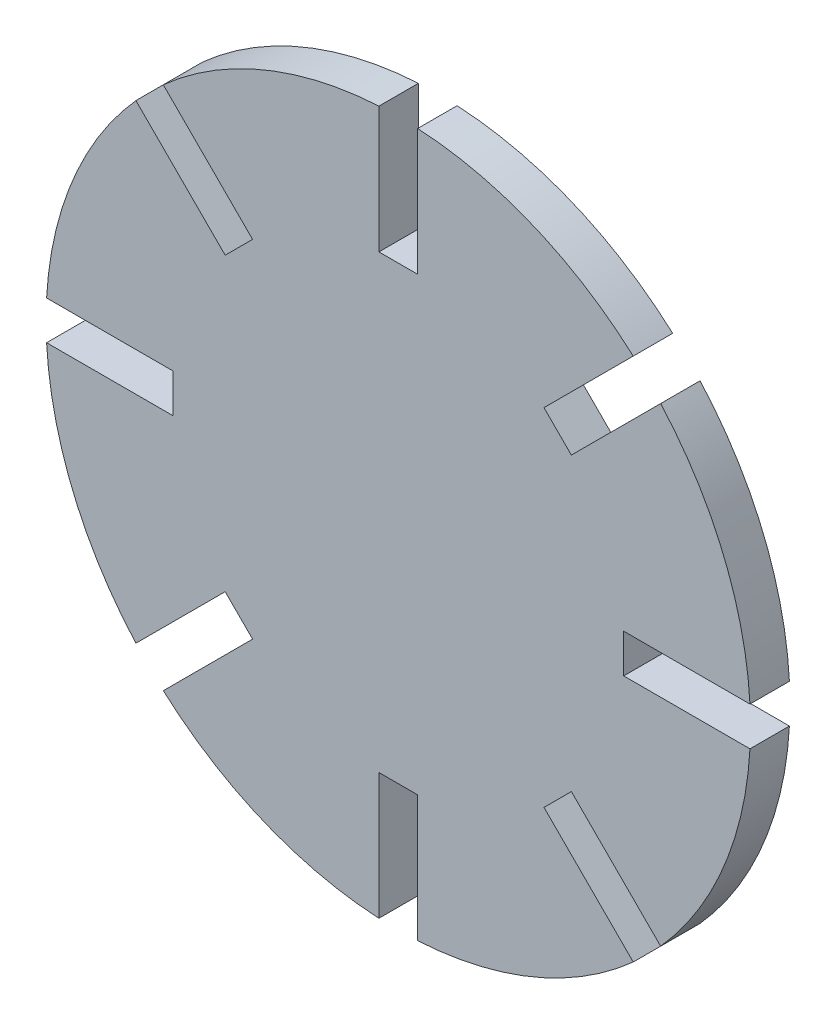
ISO-10303-21;
HEADER;
FILE_DESCRIPTION(('STEP AP214'),'2;1');
FILE_NAME('part.step','',(''),(''),'','','');
FILE_SCHEMA(('AUTOMOTIVE_DESIGN { 1 0 10303 214 1 1 1 1 }'));
ENDSEC;
DATA;
#1=APPLICATION_CONTEXT('core data for automotive mechanical design processes');
#2=APPLICATION_PROTOCOL_DEFINITION('international standard','automotive_design',2000,#1);
#3=PRODUCT_CONTEXT('',#1,'mechanical');
#4=PRODUCT('Part','Part','',(#3));
#5=PRODUCT_RELATED_PRODUCT_CATEGORY('part','',(#4));
#6=PRODUCT_DEFINITION_FORMATION('','',#4);
#7=PRODUCT_DEFINITION_CONTEXT('part definition',#1,'design');
#8=PRODUCT_DEFINITION('design','',#6,#7);
#9=PRODUCT_DEFINITION_SHAPE('','',#8);
#10=(LENGTH_UNIT() NAMED_UNIT(*) SI_UNIT(.MILLI.,.METRE.));
#11=(NAMED_UNIT(*) PLANE_ANGLE_UNIT() SI_UNIT($,.RADIAN.));
#12=(NAMED_UNIT(*) SI_UNIT($,.STERADIAN.) SOLID_ANGLE_UNIT());
#13=UNCERTAINTY_MEASURE_WITH_UNIT(LENGTH_MEASURE(1.E-05),#10,'distance_accuracy_value','');
#14=(GEOMETRIC_REPRESENTATION_CONTEXT(3) GLOBAL_UNCERTAINTY_ASSIGNED_CONTEXT((#13)) GLOBAL_UNIT_ASSIGNED_CONTEXT((#10,
#11,#12)) REPRESENTATION_CONTEXT('',''));
#15=CARTESIAN_POINT('',(0.,0.,0.));
#16=DIRECTION('',(0.,0.,1.));
#17=DIRECTION('',(1.,0.,0.));
#18=AXIS2_PLACEMENT_3D('',#15,#16,#17);
#19=CARTESIAN_POINT('',(0.,0.,2.8));
#20=DIRECTION('',(0.,0.,-1.));
#21=DIRECTION('',(-1.,0.,0.));
#22=AXIS2_PLACEMENT_3D('',#19,#20,#21);
#23=CYLINDRICAL_SURFACE('',#22,25.);
#24=DIRECTION('',(0.,0.,-1.));
#25=VECTOR('',#24,1.);
#26=CARTESIAN_POINT('',(-24.9621588609639,1.37499999999991,2.8));
#27=LINE('',#26,#25);
#28=CARTESIAN_POINT('',(-24.9621588609639,1.37499999999991,2.8));
#29=VERTEX_POINT('',#28);
#30=CARTESIAN_POINT('',(-24.9621588609639,1.37499999999991,0.));
#31=VERTEX_POINT('',#30);
#32=EDGE_CURVE('E397',#29,#31,#27,.T.);
#33=ORIENTED_EDGE('',*,*,#32,.F.);
#34=CARTESIAN_POINT('',(0.,0.,2.8));
#35=DIRECTION('',(0.,0.,1.));
#36=DIRECTION('',(1.,0.,0.));
#37=AXIS2_PLACEMENT_3D('',#34,#35,#36);
#38=CIRCLE('',#37,25.);
#39=CARTESIAN_POINT('',(-18.623183627775,16.6786399795119,2.8));
#40=VERTEX_POINT('',#39);
#41=EDGE_CURVE('E427',#40,#29,#38,.T.);
#42=ORIENTED_EDGE('',*,*,#41,.F.);
#43=DIRECTION('',(0.,0.,-1.));
#44=VECTOR('',#43,1.);
#45=CARTESIAN_POINT('',(-18.623183627775,16.6786399795119,2.8));
#46=LINE('',#45,#44);
#47=CARTESIAN_POINT('',(-18.623183627775,16.6786399795119,0.));
#48=VERTEX_POINT('',#47);
#49=EDGE_CURVE('E372',#48,#40,#46,.F.);
#50=ORIENTED_EDGE('',*,*,#49,.F.);
#51=CARTESIAN_POINT('',(0.,0.,0.));
#52=DIRECTION('',(0.,0.,1.));
#53=DIRECTION('',(1.,0.,0.));
#54=AXIS2_PLACEMENT_3D('',#51,#52,#53);
#55=CIRCLE('',#54,25.);
#56=EDGE_CURVE('E432',#48,#31,#55,.T.);
#57=ORIENTED_EDGE('',*,*,#56,.T.);
#58=EDGE_LOOP('',(#33,#42,#50,#57));
#59=FACE_BOUND('',#58,.T.);
#60=ADVANCED_FACE('F33',(#59),#23,.T.);
#61=DIRECTION('',(0.,0.,-1.));
#62=VECTOR('',#61,1.);
#63=CARTESIAN_POINT('',(-24.9621588609639,-1.37500000000009,2.8));
#64=LINE('',#63,#62);
#65=CARTESIAN_POINT('',(-24.9621588609639,-1.37500000000009,0.));
#66=VERTEX_POINT('',#65);
#67=CARTESIAN_POINT('',(-24.9621588609639,-1.37500000000009,2.8));
#68=VERTEX_POINT('',#67);
#69=EDGE_CURVE('E395',#66,#68,#64,.F.);
#70=ORIENTED_EDGE('',*,*,#69,.F.);
#71=CARTESIAN_POINT('',(-18.6231836277749,-16.6786399795121,0.));
#72=VERTEX_POINT('',#71);
#73=EDGE_CURVE('E461',#66,#72,#55,.T.);
#74=ORIENTED_EDGE('',*,*,#73,.T.);
#75=DIRECTION('',(0.,0.,-1.));
#76=VECTOR('',#75,1.);
#77=CARTESIAN_POINT('',(-18.6231836277749,-16.6786399795121,2.8));
#78=LINE('',#77,#76);
#79=CARTESIAN_POINT('',(-18.6231836277749,-16.6786399795121,2.8));
#80=VERTEX_POINT('',#79);
#81=EDGE_CURVE('E393',#80,#72,#78,.T.);
#82=ORIENTED_EDGE('',*,*,#81,.F.);
#83=EDGE_CURVE('E511',#68,#80,#38,.T.);
#84=ORIENTED_EDGE('',*,*,#83,.F.);
#85=EDGE_LOOP('',(#70,#74,#82,#84));
#86=FACE_BOUND('',#85,.T.);
#87=ADVANCED_FACE('F539',(#86),#23,.T.);
#88=DIRECTION('',(0.,0.,-1.));
#89=VECTOR('',#88,1.);
#90=CARTESIAN_POINT('',(-16.6786399795119,-18.6231836277751,2.8));
#91=LINE('',#90,#89);
#92=CARTESIAN_POINT('',(-16.6786399795119,-18.6231836277751,0.));
#93=VERTEX_POINT('',#92);
#94=CARTESIAN_POINT('',(-16.6786399795119,-18.6231836277751,2.8));
#95=VERTEX_POINT('',#94);
#96=EDGE_CURVE('E391',#93,#95,#91,.F.);
#97=ORIENTED_EDGE('',*,*,#96,.F.);
#98=CARTESIAN_POINT('',(-1.375,-24.9621588609639,0.));
#99=VERTEX_POINT('',#98);
#100=EDGE_CURVE('E457',#93,#99,#55,.T.);
#101=ORIENTED_EDGE('',*,*,#100,.T.);
#102=DIRECTION('',(0.,0.,-1.));
#103=VECTOR('',#102,1.);
#104=CARTESIAN_POINT('',(-1.375,-24.9621588609639,2.8));
#105=LINE('',#104,#103);
#106=CARTESIAN_POINT('',(-1.375,-24.9621588609639,2.8));
#107=VERTEX_POINT('',#106);
#108=EDGE_CURVE('E389',#107,#99,#105,.T.);
#109=ORIENTED_EDGE('',*,*,#108,.F.);
#110=EDGE_CURVE('E459',#95,#107,#38,.T.);
#111=ORIENTED_EDGE('',*,*,#110,.F.);
#112=EDGE_LOOP('',(#97,#101,#109,#111));
#113=FACE_BOUND('',#112,.T.);
#114=ADVANCED_FACE('F455',(#113),#23,.T.);
#115=DIRECTION('',(0.,0.,-1.));
#116=VECTOR('',#115,1.);
#117=CARTESIAN_POINT('',(1.375,-24.9621588609639,2.8));
#118=LINE('',#117,#116);
#119=CARTESIAN_POINT('',(1.375,-24.9621588609639,0.));
#120=VERTEX_POINT('',#119);
#121=CARTESIAN_POINT('',(1.375,-24.9621588609639,2.8));
#122=VERTEX_POINT('',#121);
#123=EDGE_CURVE('E387',#120,#122,#118,.F.);
#124=ORIENTED_EDGE('',*,*,#123,.F.);
#125=CARTESIAN_POINT('',(16.6786399795121,-18.6231836277748,0.));
#126=VERTEX_POINT('',#125);
#127=EDGE_CURVE('E462',#120,#126,#55,.T.);
#128=ORIENTED_EDGE('',*,*,#127,.T.);
#129=DIRECTION('',(0.,0.,-1.));
#130=VECTOR('',#129,1.);
#131=CARTESIAN_POINT('',(16.6786399795121,-18.6231836277748,2.8));
#132=LINE('',#131,#130);
#133=CARTESIAN_POINT('',(16.6786399795121,-18.6231836277748,2.8));
#134=VERTEX_POINT('',#133);
#135=EDGE_CURVE('E385',#134,#126,#132,.T.);
#136=ORIENTED_EDGE('',*,*,#135,.F.);
#137=EDGE_CURVE('E504',#122,#134,#38,.T.);
#138=ORIENTED_EDGE('',*,*,#137,.F.);
#139=EDGE_LOOP('',(#124,#128,#136,#138));
#140=FACE_BOUND('',#139,.T.);
#141=ADVANCED_FACE('F792',(#140),#23,.T.);
#142=DIRECTION('',(0.,0.,-1.));
#143=VECTOR('',#142,1.);
#144=CARTESIAN_POINT('',(18.6231836277751,-16.6786399795118,2.8));
#145=LINE('',#144,#143);
#146=CARTESIAN_POINT('',(18.6231836277751,-16.6786399795118,0.));
#147=VERTEX_POINT('',#146);
#148=CARTESIAN_POINT('',(18.6231836277751,-16.6786399795118,2.8));
#149=VERTEX_POINT('',#148);
#150=EDGE_CURVE('E383',#147,#149,#145,.F.);
#151=ORIENTED_EDGE('',*,*,#150,.F.);
#152=CARTESIAN_POINT('',(24.9621588609639,-1.37499999999974,0.));
#153=VERTEX_POINT('',#152);
#154=EDGE_CURVE('E465',#147,#153,#55,.T.);
#155=ORIENTED_EDGE('',*,*,#154,.T.);
#156=DIRECTION('',(0.,0.,-1.));
#157=VECTOR('',#156,1.);
#158=CARTESIAN_POINT('',(24.9621588609639,-1.37499999999974,2.8));
#159=LINE('',#158,#157);
#160=CARTESIAN_POINT('',(24.9621588609639,-1.37499999999974,2.8));
#161=VERTEX_POINT('',#160);
#162=EDGE_CURVE('E381',#161,#153,#159,.T.);
#163=ORIENTED_EDGE('',*,*,#162,.F.);
#164=EDGE_CURVE('E502',#149,#161,#38,.T.);
#165=ORIENTED_EDGE('',*,*,#164,.F.);
#166=EDGE_LOOP('',(#151,#155,#163,#165));
#167=FACE_BOUND('',#166,.T.);
#168=ADVANCED_FACE('F798',(#167),#23,.T.);
#169=DIRECTION('',(0.,0.,-1.));
#170=VECTOR('',#169,1.);
#171=CARTESIAN_POINT('',(24.9621588609639,1.37500000000026,2.8));
#172=LINE('',#171,#170);
#173=CARTESIAN_POINT('',(24.9621588609639,1.37500000000026,0.));
#174=VERTEX_POINT('',#173);
#175=CARTESIAN_POINT('',(24.9621588609639,1.37500000000026,2.8));
#176=VERTEX_POINT('',#175);
#177=EDGE_CURVE('E247',#174,#176,#172,.F.);
#178=ORIENTED_EDGE('',*,*,#177,.F.);
#179=CARTESIAN_POINT('',(18.6231836277748,16.6786399795122,0.));
#180=VERTEX_POINT('',#179);
#181=EDGE_CURVE('E471',#174,#180,#55,.T.);
#182=ORIENTED_EDGE('',*,*,#181,.T.);
#183=DIRECTION('',(0.,0.,-1.));
#184=VECTOR('',#183,1.);
#185=CARTESIAN_POINT('',(18.6231836277748,16.6786399795122,2.8));
#186=LINE('',#185,#184);
#187=CARTESIAN_POINT('',(18.6231836277748,16.6786399795122,2.8));
#188=VERTEX_POINT('',#187);
#189=EDGE_CURVE('E378',#188,#180,#186,.T.);
#190=ORIENTED_EDGE('',*,*,#189,.F.);
#191=EDGE_CURVE('E501',#176,#188,#38,.T.);
#192=ORIENTED_EDGE('',*,*,#191,.F.);
#193=EDGE_LOOP('',(#178,#182,#190,#192));
#194=FACE_BOUND('',#193,.T.);
#195=ADVANCED_FACE('F565',(#194),#23,.T.);
#196=DIRECTION('',(0.,0.,-1.));
#197=VECTOR('',#196,1.);
#198=CARTESIAN_POINT('',(16.6786399795117,18.6231836277752,2.8));
#199=LINE('',#198,#197);
#200=CARTESIAN_POINT('',(16.6786399795117,18.6231836277752,0.));
#201=VERTEX_POINT('',#200);
#202=CARTESIAN_POINT('',(16.6786399795117,18.6231836277752,2.8));
#203=VERTEX_POINT('',#202);
#204=EDGE_CURVE('E376',#201,#203,#199,.F.);
#205=ORIENTED_EDGE('',*,*,#204,.F.);
#206=CARTESIAN_POINT('',(1.375,24.9621588609639,0.));
#207=VERTEX_POINT('',#206);
#208=EDGE_CURVE('E422',#201,#207,#55,.T.);
#209=ORIENTED_EDGE('',*,*,#208,.T.);
#210=DIRECTION('',(0.,0.,-1.));
#211=VECTOR('',#210,1.);
#212=CARTESIAN_POINT('',(1.375,24.9621588609639,2.8));
#213=LINE('',#212,#211);
#214=CARTESIAN_POINT('',(1.375,24.9621588609639,2.8));
#215=VERTEX_POINT('',#214);
#216=EDGE_CURVE('E419',#215,#207,#213,.T.);
#217=ORIENTED_EDGE('',*,*,#216,.F.);
#218=EDGE_CURVE('E428',#203,#215,#38,.T.);
#219=ORIENTED_EDGE('',*,*,#218,.F.);
#220=EDGE_LOOP('',(#205,#209,#217,#219));
#221=FACE_BOUND('',#220,.T.);
#222=ADVANCED_FACE('F484',(#221),#23,.T.);
#223=DIRECTION('',(0.,0.,-1.));
#224=VECTOR('',#223,1.);
#225=CARTESIAN_POINT('',(-16.678639979512,18.6231836277749,2.8));
#226=LINE('',#225,#224);
#227=CARTESIAN_POINT('',(-16.678639979512,18.6231836277749,2.8));
#228=VERTEX_POINT('',#227);
#229=CARTESIAN_POINT('',(-16.678639979512,18.6231836277749,0.));
#230=VERTEX_POINT('',#229);
#231=EDGE_CURVE('E374',#228,#230,#226,.T.);
#232=ORIENTED_EDGE('',*,*,#231,.F.);
#233=CARTESIAN_POINT('',(-1.375,24.9621588609639,2.8));
#234=VERTEX_POINT('',#233);
#235=EDGE_CURVE('E423',#234,#228,#38,.T.);
#236=ORIENTED_EDGE('',*,*,#235,.F.);
#237=DIRECTION('',(0.,0.,-1.));
#238=VECTOR('',#237,1.);
#239=CARTESIAN_POINT('',(-1.375,24.9621588609639,2.8));
#240=LINE('',#239,#238);
#241=CARTESIAN_POINT('',(-1.375,24.9621588609639,0.));
#242=VERTEX_POINT('',#241);
#243=EDGE_CURVE('E417',#242,#234,#240,.F.);
#244=ORIENTED_EDGE('',*,*,#243,.F.);
#245=EDGE_CURVE('E429',#242,#230,#55,.T.);
#246=ORIENTED_EDGE('',*,*,#245,.T.);
#247=EDGE_LOOP('',(#232,#236,#244,#246));
#248=FACE_BOUND('',#247,.T.);
#249=ADVANCED_FACE('F554',(#248),#23,.T.);
#250=CARTESIAN_POINT('',(0.,0.,2.8));
#251=DIRECTION('',(0.,0.,1.));
#252=DIRECTION('',(1.,0.,0.));
#253=AXIS2_PLACEMENT_3D('',#250,#251,#252);
#254=PLANE('',#253);
#255=ORIENTED_EDGE('',*,*,#41,.T.);
#256=DIRECTION('',(-1.,0.,0.));
#257=VECTOR('',#256,1.);
#258=CARTESIAN_POINT('',(-34.,1.37499999999988,2.8));
#259=LINE('',#258,#257);
#260=CARTESIAN_POINT('',(-16.,1.37499999999995,2.8));
#261=VERTEX_POINT('',#260);
#262=EDGE_CURVE('E294',#261,#29,#259,.T.);
#263=ORIENTED_EDGE('',*,*,#262,.F.);
#264=DIRECTION('',(0.,1.,0.));
#265=VECTOR('',#264,1.);
#266=CARTESIAN_POINT('',(-16.,-1.37500000000005,2.8));
#267=LINE('',#266,#265);
#268=CARTESIAN_POINT('',(-16.,-1.37500000000005,2.8));
#269=VERTEX_POINT('',#268);
#270=EDGE_CURVE('E299',#269,#261,#267,.T.);
#271=ORIENTED_EDGE('',*,*,#270,.F.);
#272=DIRECTION('',(1.,0.,0.));
#273=VECTOR('',#272,1.);
#274=CARTESIAN_POINT('',(-34.,-1.37500000000012,2.8));
#275=LINE('',#274,#273);
#276=EDGE_CURVE('E296',#68,#269,#275,.T.);
#277=ORIENTED_EDGE('',*,*,#276,.F.);
#278=ORIENTED_EDGE('',*,*,#83,.T.);
#279=DIRECTION('',(-0.707106781186544,-0.707106781186551,0.));
#280=VECTOR('',#279,1.);
#281=CARTESIAN_POINT('',(-25.013902384474,-23.0693587362112,2.8));
#282=LINE('',#281,#280);
#283=CARTESIAN_POINT('',(-12.2859803231162,-10.3414366748533,2.8));
#284=VERTEX_POINT('',#283);
#285=EDGE_CURVE('E310',#284,#80,#282,.T.);
#286=ORIENTED_EDGE('',*,*,#285,.F.);
#287=DIRECTION('',(-0.707106781186551,0.707106781186544,0.));
#288=VECTOR('',#287,1.);
#289=CARTESIAN_POINT('',(-10.3414366748532,-12.2859803231163,2.8));
#290=LINE('',#289,#288);
#291=CARTESIAN_POINT('',(-10.3414366748532,-12.2859803231163,2.8));
#292=VERTEX_POINT('',#291);
#293=EDGE_CURVE('E315',#292,#284,#290,.T.);
#294=ORIENTED_EDGE('',*,*,#293,.F.);
#295=DIRECTION('',(0.707106781186544,0.707106781186551,0.));
#296=VECTOR('',#295,1.);
#297=CARTESIAN_POINT('',(-23.069358736211,-25.0139023844742,2.8));
#298=LINE('',#297,#296);
#299=EDGE_CURVE('E312',#95,#292,#298,.T.);
#300=ORIENTED_EDGE('',*,*,#299,.F.);
#301=ORIENTED_EDGE('',*,*,#110,.T.);
#302=DIRECTION('',(0.,-1.,0.));
#303=VECTOR('',#302,1.);
#304=CARTESIAN_POINT('',(-1.375,-34.,2.8));
#305=LINE('',#304,#303);
#306=CARTESIAN_POINT('',(-1.375,-16.,2.8));
#307=VERTEX_POINT('',#306);
#308=EDGE_CURVE('E324',#307,#107,#305,.T.);
#309=ORIENTED_EDGE('',*,*,#308,.F.);
#310=DIRECTION('',(-1.,0.,0.));
#311=VECTOR('',#310,1.);
#312=CARTESIAN_POINT('',(1.375,-16.,2.8));
#313=LINE('',#312,#311);
#314=CARTESIAN_POINT('',(1.375,-16.,2.8));
#315=VERTEX_POINT('',#314);
#316=EDGE_CURVE('E329',#315,#307,#313,.T.);
#317=ORIENTED_EDGE('',*,*,#316,.F.);
#318=DIRECTION('',(0.,1.,0.));
#319=VECTOR('',#318,1.);
#320=CARTESIAN_POINT('',(1.375,-34.,2.8));
#321=LINE('',#320,#319);
#322=EDGE_CURVE('E326',#122,#315,#321,.T.);
#323=ORIENTED_EDGE('',*,*,#322,.F.);
#324=ORIENTED_EDGE('',*,*,#137,.T.);
#325=DIRECTION('',(0.707106781186554,-0.707106781186541,0.));
#326=VECTOR('',#325,1.);
#327=CARTESIAN_POINT('',(23.0693587362113,-25.0139023844739,2.8));
#328=LINE('',#327,#326);
#329=CARTESIAN_POINT('',(10.3414366748534,-12.2859803231162,2.8));
#330=VERTEX_POINT('',#329);
#331=EDGE_CURVE('E341',#330,#134,#328,.T.);
#332=ORIENTED_EDGE('',*,*,#331,.F.);
#333=DIRECTION('',(-0.707106781186541,-0.707106781186554,0.));
#334=VECTOR('',#333,1.);
#335=CARTESIAN_POINT('',(12.2859803231164,-10.3414366748532,2.8));
#336=LINE('',#335,#334);
#337=CARTESIAN_POINT('',(12.2859803231164,-10.3414366748532,2.8));
#338=VERTEX_POINT('',#337);
#339=EDGE_CURVE('E346',#338,#330,#336,.T.);
#340=ORIENTED_EDGE('',*,*,#339,.F.);
#341=DIRECTION('',(-0.707106781186554,0.707106781186541,0.));
#342=VECTOR('',#341,1.);
#343=CARTESIAN_POINT('',(25.0139023844743,-23.0693587362109,2.8));
#344=LINE('',#343,#342);
#345=EDGE_CURVE('E343',#149,#338,#344,.T.);
#346=ORIENTED_EDGE('',*,*,#345,.F.);
#347=ORIENTED_EDGE('',*,*,#164,.T.);
#348=DIRECTION('',(1.,0.,0.));
#349=VECTOR('',#348,1.);
#350=CARTESIAN_POINT('',(34.,-1.37499999999964,2.8));
#351=LINE('',#350,#349);
#352=CARTESIAN_POINT('',(16.,-1.37499999999983,2.8));
#353=VERTEX_POINT('',#352);
#354=EDGE_CURVE('E253',#353,#161,#351,.T.);
#355=ORIENTED_EDGE('',*,*,#354,.F.);
#356=DIRECTION('',(0.,-1.,0.));
#357=VECTOR('',#356,1.);
#358=CARTESIAN_POINT('',(16.,1.37500000000017,2.8));
#359=LINE('',#358,#357);
#360=CARTESIAN_POINT('',(16.,1.37500000000017,2.8));
#361=VERTEX_POINT('',#360);
#362=EDGE_CURVE('E252',#361,#353,#359,.T.);
#363=ORIENTED_EDGE('',*,*,#362,.F.);
#364=DIRECTION('',(-1.,0.,0.));
#365=VECTOR('',#364,1.);
#366=CARTESIAN_POINT('',(34.,1.37500000000036,2.8));
#367=LINE('',#366,#365);
#368=EDGE_CURVE('E241',#176,#361,#367,.T.);
#369=ORIENTED_EDGE('',*,*,#368,.F.);
#370=ORIENTED_EDGE('',*,*,#191,.T.);
#371=DIRECTION('',(0.707106781186539,0.707106781186556,0.));
#372=VECTOR('',#371,1.);
#373=CARTESIAN_POINT('',(25.0139023844738,23.0693587362114,2.8));
#374=LINE('',#373,#372);
#375=CARTESIAN_POINT('',(12.2859803231161,10.3414366748534,2.8));
#376=VERTEX_POINT('',#375);
#377=EDGE_CURVE('E278',#376,#188,#374,.T.);
#378=ORIENTED_EDGE('',*,*,#377,.F.);
#379=DIRECTION('',(0.707106781186556,-0.707106781186539,0.));
#380=VECTOR('',#379,1.);
#381=CARTESIAN_POINT('',(10.3414366748531,12.2859803231164,2.8));
#382=LINE('',#381,#380);
#383=CARTESIAN_POINT('',(10.3414366748531,12.2859803231164,2.8));
#384=VERTEX_POINT('',#383);
#385=EDGE_CURVE('E283',#384,#376,#382,.T.);
#386=ORIENTED_EDGE('',*,*,#385,.F.);
#387=DIRECTION('',(-0.707106781186539,-0.707106781186556,0.));
#388=VECTOR('',#387,1.);
#389=CARTESIAN_POINT('',(23.0693587362108,25.0139023844744,2.8));
#390=LINE('',#389,#388);
#391=EDGE_CURVE('E280',#203,#384,#390,.T.);
#392=ORIENTED_EDGE('',*,*,#391,.F.);
#393=ORIENTED_EDGE('',*,*,#218,.T.);
#394=DIRECTION('',(0.,1.,0.));
#395=VECTOR('',#394,1.);
#396=CARTESIAN_POINT('',(1.375,34.,2.8));
#397=LINE('',#396,#395);
#398=CARTESIAN_POINT('',(1.375,16.,2.8));
#399=VERTEX_POINT('',#398);
#400=EDGE_CURVE('E400',#399,#215,#397,.T.);
#401=ORIENTED_EDGE('',*,*,#400,.F.);
#402=DIRECTION('',(1.,0.,0.));
#403=VECTOR('',#402,1.);
#404=CARTESIAN_POINT('',(-1.375,16.,2.8));
#405=LINE('',#404,#403);
#406=CARTESIAN_POINT('',(-1.375,16.,2.8));
#407=VERTEX_POINT('',#406);
#408=EDGE_CURVE('E406',#407,#399,#405,.T.);
#409=ORIENTED_EDGE('',*,*,#408,.F.);
#410=DIRECTION('',(0.,-1.,0.));
#411=VECTOR('',#410,1.);
#412=CARTESIAN_POINT('',(-1.375,34.,2.8));
#413=LINE('',#412,#411);
#414=EDGE_CURVE('E403',#234,#407,#413,.T.);
#415=ORIENTED_EDGE('',*,*,#414,.F.);
#416=ORIENTED_EDGE('',*,*,#235,.T.);
#417=DIRECTION('',(-0.707106781186549,0.707106781186546,0.));
#418=VECTOR('',#417,1.);
#419=CARTESIAN_POINT('',(-23.0693587362112,25.0139023844741,2.8));
#420=LINE('',#419,#418);
#421=CARTESIAN_POINT('',(-10.3414366748533,12.2859803231163,2.8));
#422=VERTEX_POINT('',#421);
#423=EDGE_CURVE('E356',#422,#228,#420,.T.);
#424=ORIENTED_EDGE('',*,*,#423,.F.);
#425=DIRECTION('',(0.707106781186546,0.707106781186549,0.));
#426=VECTOR('',#425,1.);
#427=CARTESIAN_POINT('',(-12.2859803231163,10.3414366748532,2.8));
#428=LINE('',#427,#426);
#429=CARTESIAN_POINT('',(-12.2859803231163,10.3414366748532,2.8));
#430=VERTEX_POINT('',#429);
#431=EDGE_CURVE('E361',#430,#422,#428,.T.);
#432=ORIENTED_EDGE('',*,*,#431,.F.);
#433=DIRECTION('',(0.707106781186549,-0.707106781186546,0.));
#434=VECTOR('',#433,1.);
#435=CARTESIAN_POINT('',(-25.0139023844742,23.0693587362111,2.8));
#436=LINE('',#435,#434);
#437=EDGE_CURVE('E358',#40,#430,#436,.T.);
#438=ORIENTED_EDGE('',*,*,#437,.F.);
#439=EDGE_LOOP('',(#255,#263,#271,#277,#278,#286,#294,#300,#301,#309,#317,#323,#324,#332,#340,
#346,#347,#355,#363,#369,#370,#378,#386,#392,#393,#401,#409,#415,#416,#424,#432,#438));
#440=FACE_BOUND('',#439,.T.);
#441=ADVANCED_FACE('F267',(#440),#254,.T.);
#442=CARTESIAN_POINT('',(0.,0.,0.));
#443=DIRECTION('',(0.,0.,1.));
#444=DIRECTION('',(1.,0.,0.));
#445=AXIS2_PLACEMENT_3D('',#442,#443,#444);
#446=PLANE('',#445);
#447=DIRECTION('',(-1.,0.,0.));
#448=VECTOR('',#447,1.);
#449=CARTESIAN_POINT('',(-34.,1.37499999999988,0.));
#450=LINE('',#449,#448);
#451=CARTESIAN_POINT('',(-16.,1.37499999999995,0.));
#452=VERTEX_POINT('',#451);
#453=EDGE_CURVE('E47',#452,#31,#450,.T.);
#454=ORIENTED_EDGE('',*,*,#453,.T.);
#455=ORIENTED_EDGE('',*,*,#56,.F.);
#456=DIRECTION('',(-0.707106781186549,0.707106781186546,0.));
#457=VECTOR('',#456,1.);
#458=CARTESIAN_POINT('',(-0.972271824131494,-0.972271824131498,0.));
#459=LINE('',#458,#457);
#460=CARTESIAN_POINT('',(-12.2859803231163,10.3414366748532,0.));
#461=VERTEX_POINT('',#460);
#462=EDGE_CURVE('E434',#461,#48,#459,.T.);
#463=ORIENTED_EDGE('',*,*,#462,.F.);
#464=DIRECTION('',(0.707106781186546,0.707106781186549,0.));
#465=VECTOR('',#464,1.);
#466=CARTESIAN_POINT('',(-12.2859803231163,10.3414366748532,0.));
#467=LINE('',#466,#465);
#468=CARTESIAN_POINT('',(-10.3414366748533,12.2859803231163,0.));
#469=VERTEX_POINT('',#468);
#470=EDGE_CURVE('E359',#461,#469,#467,.T.);
#471=ORIENTED_EDGE('',*,*,#470,.T.);
#472=DIRECTION('',(-0.707106781186549,0.707106781186546,0.));
#473=VECTOR('',#472,1.);
#474=CARTESIAN_POINT('',(-23.0693587362112,25.0139023844741,0.));
#475=LINE('',#474,#473);
#476=EDGE_CURVE('E309',#469,#230,#475,.T.);
#477=ORIENTED_EDGE('',*,*,#476,.T.);
#478=ORIENTED_EDGE('',*,*,#245,.F.);
#479=DIRECTION('',(0.,1.,0.));
#480=VECTOR('',#479,1.);
#481=CARTESIAN_POINT('',(-1.375,0.,0.));
#482=LINE('',#481,#480);
#483=CARTESIAN_POINT('',(-1.375,16.,0.));
#484=VERTEX_POINT('',#483);
#485=EDGE_CURVE('E426',#484,#242,#482,.T.);
#486=ORIENTED_EDGE('',*,*,#485,.F.);
#487=DIRECTION('',(1.,0.,0.));
#488=VECTOR('',#487,1.);
#489=CARTESIAN_POINT('',(-1.375,16.,0.));
#490=LINE('',#489,#488);
#491=CARTESIAN_POINT('',(1.375,16.,0.));
#492=VERTEX_POINT('',#491);
#493=EDGE_CURVE('E404',#484,#492,#490,.T.);
#494=ORIENTED_EDGE('',*,*,#493,.T.);
#495=DIRECTION('',(0.,1.,0.));
#496=VECTOR('',#495,1.);
#497=CARTESIAN_POINT('',(1.375,34.,0.));
#498=LINE('',#497,#496);
#499=EDGE_CURVE('E399',#492,#207,#498,.T.);
#500=ORIENTED_EDGE('',*,*,#499,.T.);
#501=ORIENTED_EDGE('',*,*,#208,.F.);
#502=DIRECTION('',(0.707106781186539,0.707106781186556,0.));
#503=VECTOR('',#502,1.);
#504=CARTESIAN_POINT('',(-0.972271824131511,0.972271824131487,0.));
#505=LINE('',#504,#503);
#506=CARTESIAN_POINT('',(10.3414366748531,12.2859803231164,0.));
#507=VERTEX_POINT('',#506);
#508=EDGE_CURVE('E436',#507,#201,#505,.T.);
#509=ORIENTED_EDGE('',*,*,#508,.F.);
#510=DIRECTION('',(0.707106781186556,-0.707106781186539,0.));
#511=VECTOR('',#510,1.);
#512=CARTESIAN_POINT('',(10.3414366748531,12.2859803231164,0.));
#513=LINE('',#512,#511);
#514=CARTESIAN_POINT('',(12.2859803231161,10.3414366748534,0.));
#515=VERTEX_POINT('',#514);
#516=EDGE_CURVE('E281',#507,#515,#513,.T.);
#517=ORIENTED_EDGE('',*,*,#516,.T.);
#518=DIRECTION('',(0.707106781186539,0.707106781186556,0.));
#519=VECTOR('',#518,1.);
#520=CARTESIAN_POINT('',(25.0139023844738,23.0693587362114,0.));
#521=LINE('',#520,#519);
#522=EDGE_CURVE('E286',#515,#180,#521,.T.);
#523=ORIENTED_EDGE('',*,*,#522,.T.);
#524=ORIENTED_EDGE('',*,*,#181,.F.);
#525=DIRECTION('',(1.,0.,0.));
#526=VECTOR('',#525,1.);
#527=CARTESIAN_POINT('',(0.,1.375,0.));
#528=LINE('',#527,#526);
#529=CARTESIAN_POINT('',(16.,1.37500000000017,0.));
#530=VERTEX_POINT('',#529);
#531=EDGE_CURVE('E438',#530,#174,#528,.T.);
#532=ORIENTED_EDGE('',*,*,#531,.F.);
#533=DIRECTION('',(0.,-1.,0.));
#534=VECTOR('',#533,1.);
#535=CARTESIAN_POINT('',(16.,1.37500000000017,0.));
#536=LINE('',#535,#534);
#537=CARTESIAN_POINT('',(16.,-1.37499999999983,0.));
#538=VERTEX_POINT('',#537);
#539=EDGE_CURVE('E260',#530,#538,#536,.T.);
#540=ORIENTED_EDGE('',*,*,#539,.T.);
#541=DIRECTION('',(1.,0.,0.));
#542=VECTOR('',#541,1.);
#543=CARTESIAN_POINT('',(34.,-1.37499999999964,0.));
#544=LINE('',#543,#542);
#545=EDGE_CURVE('E273',#538,#153,#544,.T.);
#546=ORIENTED_EDGE('',*,*,#545,.T.);
#547=ORIENTED_EDGE('',*,*,#154,.F.);
#548=DIRECTION('',(0.707106781186554,-0.707106781186541,0.));
#549=VECTOR('',#548,1.);
#550=CARTESIAN_POINT('',(0.972271824131493,0.97227182413151,0.));
#551=LINE('',#550,#549);
#552=CARTESIAN_POINT('',(12.2859803231164,-10.3414366748532,0.));
#553=VERTEX_POINT('',#552);
#554=EDGE_CURVE('E440',#553,#147,#551,.T.);
#555=ORIENTED_EDGE('',*,*,#554,.F.);
#556=DIRECTION('',(-0.707106781186541,-0.707106781186554,0.));
#557=VECTOR('',#556,1.);
#558=CARTESIAN_POINT('',(12.2859803231164,-10.3414366748532,0.));
#559=LINE('',#558,#557);
#560=CARTESIAN_POINT('',(10.3414366748534,-12.2859803231162,0.));
#561=VERTEX_POINT('',#560);
#562=EDGE_CURVE('E344',#553,#561,#559,.T.);
#563=ORIENTED_EDGE('',*,*,#562,.T.);
#564=DIRECTION('',(0.707106781186554,-0.707106781186541,0.));
#565=VECTOR('',#564,1.);
#566=CARTESIAN_POINT('',(23.0693587362113,-25.0139023844739,0.));
#567=LINE('',#566,#565);
#568=EDGE_CURVE('E262',#561,#126,#567,.T.);
#569=ORIENTED_EDGE('',*,*,#568,.T.);
#570=ORIENTED_EDGE('',*,*,#127,.F.);
#571=DIRECTION('',(0.,-1.,0.));
#572=VECTOR('',#571,1.);
#573=CARTESIAN_POINT('',(1.375,0.,0.));
#574=LINE('',#573,#572);
#575=CARTESIAN_POINT('',(1.375,-16.,0.));
#576=VERTEX_POINT('',#575);
#577=EDGE_CURVE('E442',#576,#120,#574,.T.);
#578=ORIENTED_EDGE('',*,*,#577,.F.);
#579=DIRECTION('',(-1.,0.,0.));
#580=VECTOR('',#579,1.);
#581=CARTESIAN_POINT('',(1.375,-16.,0.));
#582=LINE('',#581,#580);
#583=CARTESIAN_POINT('',(-1.375,-16.,0.));
#584=VERTEX_POINT('',#583);
#585=EDGE_CURVE('E327',#576,#584,#582,.T.);
#586=ORIENTED_EDGE('',*,*,#585,.T.);
#587=DIRECTION('',(0.,-1.,0.));
#588=VECTOR('',#587,1.);
#589=CARTESIAN_POINT('',(-1.375,-34.,0.));
#590=LINE('',#589,#588);
#591=EDGE_CURVE('E332',#584,#99,#590,.T.);
#592=ORIENTED_EDGE('',*,*,#591,.T.);
#593=ORIENTED_EDGE('',*,*,#100,.F.);
#594=DIRECTION('',(-0.707106781186544,-0.707106781186551,0.));
#595=VECTOR('',#594,1.);
#596=CARTESIAN_POINT('',(0.972271824131504,-0.972271824131494,0.));
#597=LINE('',#596,#595);
#598=CARTESIAN_POINT('',(-10.3414366748532,-12.2859803231163,0.));
#599=VERTEX_POINT('',#598);
#600=EDGE_CURVE('E40',#599,#93,#597,.T.);
#601=ORIENTED_EDGE('',*,*,#600,.F.);
#602=DIRECTION('',(-0.707106781186551,0.707106781186544,0.));
#603=VECTOR('',#602,1.);
#604=CARTESIAN_POINT('',(-10.3414366748532,-12.2859803231163,0.));
#605=LINE('',#604,#603);
#606=CARTESIAN_POINT('',(-12.2859803231162,-10.3414366748533,0.));
#607=VERTEX_POINT('',#606);
#608=EDGE_CURVE('E313',#599,#607,#605,.T.);
#609=ORIENTED_EDGE('',*,*,#608,.T.);
#610=DIRECTION('',(-0.707106781186544,-0.707106781186551,0.));
#611=VECTOR('',#610,1.);
#612=CARTESIAN_POINT('',(-25.013902384474,-23.0693587362112,0.));
#613=LINE('',#612,#611);
#614=EDGE_CURVE('E55',#607,#72,#613,.T.);
#615=ORIENTED_EDGE('',*,*,#614,.T.);
#616=ORIENTED_EDGE('',*,*,#73,.F.);
#617=DIRECTION('',(-1.,0.,0.));
#618=VECTOR('',#617,1.);
#619=CARTESIAN_POINT('',(0.,-1.375,0.));
#620=LINE('',#619,#618);
#621=CARTESIAN_POINT('',(-16.,-1.37500000000005,0.));
#622=VERTEX_POINT('',#621);
#623=EDGE_CURVE('E11',#622,#66,#620,.T.);
#624=ORIENTED_EDGE('',*,*,#623,.F.);
#625=DIRECTION('',(0.,1.,0.));
#626=VECTOR('',#625,1.);
#627=CARTESIAN_POINT('',(-16.,-1.37500000000005,0.));
#628=LINE('',#627,#626);
#629=EDGE_CURVE('E297',#622,#452,#628,.T.);
#630=ORIENTED_EDGE('',*,*,#629,.T.);
#631=EDGE_LOOP('',(#454,#455,#463,#471,#477,#478,#486,#494,#500,#501,#509,#517,#523,#524,#532,
#540,#546,#547,#555,#563,#569,#570,#578,#586,#592,#593,#601,#609,#615,#616,#624,#630));
#632=FACE_BOUND('',#631,.T.);
#633=ADVANCED_FACE('F460',(#632),#446,.F.);
#634=CARTESIAN_POINT('',(1.375,34.,2.8));
#635=DIRECTION('',(-1.,0.,0.));
#636=DIRECTION('',(0.,-1.,0.));
#637=AXIS2_PLACEMENT_3D('',#634,#635,#636);
#638=PLANE('',#637);
#639=ORIENTED_EDGE('',*,*,#216,.T.);
#640=ORIENTED_EDGE('',*,*,#499,.F.);
#641=DIRECTION('',(0.,0.,-1.));
#642=VECTOR('',#641,1.);
#643=CARTESIAN_POINT('',(1.375,16.,2.8));
#644=LINE('',#643,#642);
#645=EDGE_CURVE('E408',#399,#492,#644,.T.);
#646=ORIENTED_EDGE('',*,*,#645,.F.);
#647=ORIENTED_EDGE('',*,*,#400,.T.);
#648=EDGE_LOOP('',(#639,#640,#646,#647));
#649=FACE_BOUND('',#648,.T.);
#650=ADVANCED_FACE('F488',(#649),#638,.T.);
#651=CARTESIAN_POINT('',(-1.375,34.,2.8));
#652=DIRECTION('',(1.,0.,0.));
#653=DIRECTION('',(0.,1.,0.));
#654=AXIS2_PLACEMENT_3D('',#651,#652,#653);
#655=PLANE('',#654);
#656=ORIENTED_EDGE('',*,*,#243,.T.);
#657=ORIENTED_EDGE('',*,*,#414,.T.);
#658=DIRECTION('',(0.,0.,-1.));
#659=VECTOR('',#658,1.);
#660=CARTESIAN_POINT('',(-1.375,16.,2.8));
#661=LINE('',#660,#659);
#662=EDGE_CURVE('E415',#407,#484,#661,.T.);
#663=ORIENTED_EDGE('',*,*,#662,.T.);
#664=ORIENTED_EDGE('',*,*,#485,.T.);
#665=EDGE_LOOP('',(#656,#657,#663,#664));
#666=FACE_BOUND('',#665,.T.);
#667=ADVANCED_FACE('F572',(#666),#655,.T.);
#668=CARTESIAN_POINT('',(-1.375,16.,2.8));
#669=DIRECTION('',(0.,1.,0.));
#670=DIRECTION('',(0.,0.,1.));
#671=AXIS2_PLACEMENT_3D('',#668,#669,#670);
#672=PLANE('',#671);
#673=ORIENTED_EDGE('',*,*,#493,.F.);
#674=ORIENTED_EDGE('',*,*,#662,.F.);
#675=ORIENTED_EDGE('',*,*,#408,.T.);
#676=ORIENTED_EDGE('',*,*,#645,.T.);
#677=EDGE_LOOP('',(#673,#674,#675,#676));
#678=FACE_BOUND('',#677,.T.);
#679=ADVANCED_FACE('F496',(#678),#672,.T.);
#680=CARTESIAN_POINT('',(-23.0693587362112,25.0139023844741,2.8));
#681=DIRECTION('',(-0.707106781186546,-0.707106781186549,0.));
#682=DIRECTION('',(0.707106781186549,-0.707106781186546,0.));
#683=AXIS2_PLACEMENT_3D('',#680,#681,#682);
#684=PLANE('',#683);
#685=ORIENTED_EDGE('',*,*,#231,.T.);
#686=ORIENTED_EDGE('',*,*,#476,.F.);
#687=DIRECTION('',(0.,0.,-1.));
#688=VECTOR('',#687,1.);
#689=CARTESIAN_POINT('',(-10.3414366748533,12.2859803231163,2.8));
#690=LINE('',#689,#688);
#691=EDGE_CURVE('E363',#422,#469,#690,.T.);
#692=ORIENTED_EDGE('',*,*,#691,.F.);
#693=ORIENTED_EDGE('',*,*,#423,.T.);
#694=EDGE_LOOP('',(#685,#686,#692,#693));
#695=FACE_BOUND('',#694,.T.);
#696=ADVANCED_FACE('F575',(#695),#684,.T.);
#697=CARTESIAN_POINT('',(-25.0139023844742,23.0693587362111,2.8));
#698=DIRECTION('',(0.707106781186546,0.707106781186549,0.));
#699=DIRECTION('',(-0.707106781186549,0.707106781186546,0.));
#700=AXIS2_PLACEMENT_3D('',#697,#698,#699);
#701=PLANE('',#700);
#702=ORIENTED_EDGE('',*,*,#49,.T.);
#703=ORIENTED_EDGE('',*,*,#437,.T.);
#704=DIRECTION('',(0.,0.,-1.));
#705=VECTOR('',#704,1.);
#706=CARTESIAN_POINT('',(-12.2859803231163,10.3414366748532,2.8));
#707=LINE('',#706,#705);
#708=EDGE_CURVE('E370',#430,#461,#707,.T.);
#709=ORIENTED_EDGE('',*,*,#708,.T.);
#710=ORIENTED_EDGE('',*,*,#462,.T.);
#711=EDGE_LOOP('',(#702,#703,#709,#710));
#712=FACE_BOUND('',#711,.T.);
#713=ADVANCED_FACE('F580',(#712),#701,.T.);
#714=CARTESIAN_POINT('',(-12.2859803231163,10.3414366748532,2.8));
#715=DIRECTION('',(-0.707106781186549,0.707106781186546,0.));
#716=DIRECTION('',(-0.707106781186546,-0.707106781186549,0.));
#717=AXIS2_PLACEMENT_3D('',#714,#715,#716);
#718=PLANE('',#717);
#719=ORIENTED_EDGE('',*,*,#470,.F.);
#720=ORIENTED_EDGE('',*,*,#708,.F.);
#721=ORIENTED_EDGE('',*,*,#431,.T.);
#722=ORIENTED_EDGE('',*,*,#691,.T.);
#723=EDGE_LOOP('',(#719,#720,#721,#722));
#724=FACE_BOUND('',#723,.T.);
#725=ADVANCED_FACE('F577',(#724),#718,.T.);
#726=CARTESIAN_POINT('',(25.0139023844738,23.0693587362114,2.8));
#727=DIRECTION('',(-0.707106781186556,0.707106781186539,0.));
#728=DIRECTION('',(-0.707106781186539,-0.707106781186556,0.));
#729=AXIS2_PLACEMENT_3D('',#726,#727,#728);
#730=PLANE('',#729);
#731=ORIENTED_EDGE('',*,*,#189,.T.);
#732=ORIENTED_EDGE('',*,*,#522,.F.);
#733=DIRECTION('',(0.,0.,-1.));
#734=VECTOR('',#733,1.);
#735=CARTESIAN_POINT('',(12.2859803231161,10.3414366748534,2.8));
#736=LINE('',#735,#734);
#737=EDGE_CURVE('E285',#376,#515,#736,.T.);
#738=ORIENTED_EDGE('',*,*,#737,.F.);
#739=ORIENTED_EDGE('',*,*,#377,.T.);
#740=EDGE_LOOP('',(#731,#732,#738,#739));
#741=FACE_BOUND('',#740,.T.);
#742=ADVANCED_FACE('F587',(#741),#730,.T.);
#743=CARTESIAN_POINT('',(23.0693587362108,25.0139023844744,2.8));
#744=DIRECTION('',(0.707106781186556,-0.707106781186539,0.));
#745=DIRECTION('',(0.707106781186539,0.707106781186556,0.));
#746=AXIS2_PLACEMENT_3D('',#743,#744,#745);
#747=PLANE('',#746);
#748=ORIENTED_EDGE('',*,*,#204,.T.);
#749=ORIENTED_EDGE('',*,*,#391,.T.);
#750=DIRECTION('',(0.,0.,-1.));
#751=VECTOR('',#750,1.);
#752=CARTESIAN_POINT('',(10.3414366748531,12.2859803231164,2.8));
#753=LINE('',#752,#751);
#754=EDGE_CURVE('E276',#384,#507,#753,.T.);
#755=ORIENTED_EDGE('',*,*,#754,.T.);
#756=ORIENTED_EDGE('',*,*,#508,.T.);
#757=EDGE_LOOP('',(#748,#749,#755,#756));
#758=FACE_BOUND('',#757,.T.);
#759=ADVANCED_FACE('F638',(#758),#747,.T.);
#760=CARTESIAN_POINT('',(10.3414366748531,12.2859803231164,2.8));
#761=DIRECTION('',(0.707106781186539,0.707106781186556,0.));
#762=DIRECTION('',(-0.707106781186556,0.707106781186539,0.));
#763=AXIS2_PLACEMENT_3D('',#760,#761,#762);
#764=PLANE('',#763);
#765=ORIENTED_EDGE('',*,*,#516,.F.);
#766=ORIENTED_EDGE('',*,*,#754,.F.);
#767=ORIENTED_EDGE('',*,*,#385,.T.);
#768=ORIENTED_EDGE('',*,*,#737,.T.);
#769=EDGE_LOOP('',(#765,#766,#767,#768));
#770=FACE_BOUND('',#769,.T.);
#771=ADVANCED_FACE('F648',(#770),#764,.T.);
#772=CARTESIAN_POINT('',(34.,-1.37499999999964,2.8));
#773=DIRECTION('',(0.,1.,0.));
#774=DIRECTION('',(-1.,0.,0.));
#775=AXIS2_PLACEMENT_3D('',#772,#773,#774);
#776=PLANE('',#775);
#777=ORIENTED_EDGE('',*,*,#162,.T.);
#778=ORIENTED_EDGE('',*,*,#545,.F.);
#779=DIRECTION('',(0.,0.,-1.));
#780=VECTOR('',#779,1.);
#781=CARTESIAN_POINT('',(16.,-1.37499999999983,2.8));
#782=LINE('',#781,#780);
#783=EDGE_CURVE('E263',#353,#538,#782,.T.);
#784=ORIENTED_EDGE('',*,*,#783,.F.);
#785=ORIENTED_EDGE('',*,*,#354,.T.);
#786=EDGE_LOOP('',(#777,#778,#784,#785));
#787=FACE_BOUND('',#786,.T.);
#788=ADVANCED_FACE('F658',(#787),#776,.T.);
#789=CARTESIAN_POINT('',(34.,1.37500000000036,2.8));
#790=DIRECTION('',(0.,-1.,0.));
#791=DIRECTION('',(1.,0.,0.));
#792=AXIS2_PLACEMENT_3D('',#789,#790,#791);
#793=PLANE('',#792);
#794=ORIENTED_EDGE('',*,*,#177,.T.);
#795=ORIENTED_EDGE('',*,*,#368,.T.);
#796=DIRECTION('',(0.,0.,-1.));
#797=VECTOR('',#796,1.);
#798=CARTESIAN_POINT('',(16.,1.37500000000017,2.8));
#799=LINE('',#798,#797);
#800=EDGE_CURVE('E244',#361,#530,#799,.T.);
#801=ORIENTED_EDGE('',*,*,#800,.T.);
#802=ORIENTED_EDGE('',*,*,#531,.T.);
#803=EDGE_LOOP('',(#794,#795,#801,#802));
#804=FACE_BOUND('',#803,.T.);
#805=ADVANCED_FACE('F243',(#804),#793,.T.);
#806=CARTESIAN_POINT('',(16.,1.37500000000017,2.8));
#807=DIRECTION('',(1.,0.,0.));
#808=DIRECTION('',(0.,1.,0.));
#809=AXIS2_PLACEMENT_3D('',#806,#807,#808);
#810=PLANE('',#809);
#811=ORIENTED_EDGE('',*,*,#539,.F.);
#812=ORIENTED_EDGE('',*,*,#800,.F.);
#813=ORIENTED_EDGE('',*,*,#362,.T.);
#814=ORIENTED_EDGE('',*,*,#783,.T.);
#815=EDGE_LOOP('',(#811,#812,#813,#814));
#816=FACE_BOUND('',#815,.T.);
#817=ADVANCED_FACE('F256',(#816),#810,.T.);
#818=CARTESIAN_POINT('',(23.0693587362113,-25.0139023844739,2.8));
#819=DIRECTION('',(0.707106781186541,0.707106781186554,0.));
#820=DIRECTION('',(-0.707106781186554,0.707106781186541,0.));
#821=AXIS2_PLACEMENT_3D('',#818,#819,#820);
#822=PLANE('',#821);
#823=ORIENTED_EDGE('',*,*,#135,.T.);
#824=ORIENTED_EDGE('',*,*,#568,.F.);
#825=DIRECTION('',(0.,0.,-1.));
#826=VECTOR('',#825,1.);
#827=CARTESIAN_POINT('',(10.3414366748534,-12.2859803231162,2.8));
#828=LINE('',#827,#826);
#829=EDGE_CURVE('E348',#330,#561,#828,.T.);
#830=ORIENTED_EDGE('',*,*,#829,.F.);
#831=ORIENTED_EDGE('',*,*,#331,.T.);
#832=EDGE_LOOP('',(#823,#824,#830,#831));
#833=FACE_BOUND('',#832,.T.);
#834=ADVANCED_FACE('F685',(#833),#822,.T.);
#835=CARTESIAN_POINT('',(25.0139023844743,-23.0693587362109,2.8));
#836=DIRECTION('',(-0.707106781186541,-0.707106781186554,0.));
#837=DIRECTION('',(0.707106781186554,-0.707106781186541,0.));
#838=AXIS2_PLACEMENT_3D('',#835,#836,#837);
#839=PLANE('',#838);
#840=ORIENTED_EDGE('',*,*,#150,.T.);
#841=ORIENTED_EDGE('',*,*,#345,.T.);
#842=DIRECTION('',(0.,0.,-1.));
#843=VECTOR('',#842,1.);
#844=CARTESIAN_POINT('',(12.2859803231164,-10.3414366748532,2.8));
#845=LINE('',#844,#843);
#846=EDGE_CURVE('E335',#338,#553,#845,.T.);
#847=ORIENTED_EDGE('',*,*,#846,.T.);
#848=ORIENTED_EDGE('',*,*,#554,.T.);
#849=EDGE_LOOP('',(#840,#841,#847,#848));
#850=FACE_BOUND('',#849,.T.);
#851=ADVANCED_FACE('F694',(#850),#839,.T.);
#852=CARTESIAN_POINT('',(12.2859803231164,-10.3414366748532,2.8));
#853=DIRECTION('',(0.707106781186554,-0.707106781186541,0.));
#854=DIRECTION('',(0.707106781186541,0.707106781186554,0.));
#855=AXIS2_PLACEMENT_3D('',#852,#853,#854);
#856=PLANE('',#855);
#857=ORIENTED_EDGE('',*,*,#562,.F.);
#858=ORIENTED_EDGE('',*,*,#846,.F.);
#859=ORIENTED_EDGE('',*,*,#339,.T.);
#860=ORIENTED_EDGE('',*,*,#829,.T.);
#861=EDGE_LOOP('',(#857,#858,#859,#860));
#862=FACE_BOUND('',#861,.T.);
#863=ADVANCED_FACE('F703',(#862),#856,.T.);
#864=CARTESIAN_POINT('',(-1.375,-34.,2.8));
#865=DIRECTION('',(1.,0.,0.));
#866=DIRECTION('',(0.,1.,0.));
#867=AXIS2_PLACEMENT_3D('',#864,#865,#866);
#868=PLANE('',#867);
#869=ORIENTED_EDGE('',*,*,#108,.T.);
#870=ORIENTED_EDGE('',*,*,#591,.F.);
#871=DIRECTION('',(0.,0.,-1.));
#872=VECTOR('',#871,1.);
#873=CARTESIAN_POINT('',(-1.375,-16.,2.8));
#874=LINE('',#873,#872);
#875=EDGE_CURVE('E331',#307,#584,#874,.T.);
#876=ORIENTED_EDGE('',*,*,#875,.F.);
#877=ORIENTED_EDGE('',*,*,#308,.T.);
#878=EDGE_LOOP('',(#869,#870,#876,#877));
#879=FACE_BOUND('',#878,.T.);
#880=ADVANCED_FACE('F713',(#879),#868,.T.);
#881=CARTESIAN_POINT('',(1.375,-34.,2.8));
#882=DIRECTION('',(-1.,0.,0.));
#883=DIRECTION('',(0.,-1.,0.));
#884=AXIS2_PLACEMENT_3D('',#881,#882,#883);
#885=PLANE('',#884);
#886=ORIENTED_EDGE('',*,*,#123,.T.);
#887=ORIENTED_EDGE('',*,*,#322,.T.);
#888=DIRECTION('',(0.,0.,-1.));
#889=VECTOR('',#888,1.);
#890=CARTESIAN_POINT('',(1.375,-16.,2.8));
#891=LINE('',#890,#889);
#892=EDGE_CURVE('E319',#315,#576,#891,.T.);
#893=ORIENTED_EDGE('',*,*,#892,.T.);
#894=ORIENTED_EDGE('',*,*,#577,.T.);
#895=EDGE_LOOP('',(#886,#887,#893,#894));
#896=FACE_BOUND('',#895,.T.);
#897=ADVANCED_FACE('F723',(#896),#885,.T.);
#898=CARTESIAN_POINT('',(1.375,-16.,2.8));
#899=DIRECTION('',(0.,-1.,0.));
#900=DIRECTION('',(0.,0.,-1.));
#901=AXIS2_PLACEMENT_3D('',#898,#899,#900);
#902=PLANE('',#901);
#903=ORIENTED_EDGE('',*,*,#585,.F.);
#904=ORIENTED_EDGE('',*,*,#892,.F.);
#905=ORIENTED_EDGE('',*,*,#316,.T.);
#906=ORIENTED_EDGE('',*,*,#875,.T.);
#907=EDGE_LOOP('',(#903,#904,#905,#906));
#908=FACE_BOUND('',#907,.T.);
#909=ADVANCED_FACE('F733',(#908),#902,.T.);
#910=CARTESIAN_POINT('',(-25.013902384474,-23.0693587362112,2.8));
#911=DIRECTION('',(0.707106781186551,-0.707106781186544,0.));
#912=DIRECTION('',(0.707106781186544,0.707106781186551,0.));
#913=AXIS2_PLACEMENT_3D('',#910,#911,#912);
#914=PLANE('',#913);
#915=ORIENTED_EDGE('',*,*,#81,.T.);
#916=ORIENTED_EDGE('',*,*,#614,.F.);
#917=DIRECTION('',(0.,0.,-1.));
#918=VECTOR('',#917,1.);
#919=CARTESIAN_POINT('',(-12.2859803231162,-10.3414366748533,2.8));
#920=LINE('',#919,#918);
#921=EDGE_CURVE('E317',#284,#607,#920,.T.);
#922=ORIENTED_EDGE('',*,*,#921,.F.);
#923=ORIENTED_EDGE('',*,*,#285,.T.);
#924=EDGE_LOOP('',(#915,#916,#922,#923));
#925=FACE_BOUND('',#924,.T.);
#926=ADVANCED_FACE('F540',(#925),#914,.T.);
#927=CARTESIAN_POINT('',(-23.069358736211,-25.0139023844742,2.8));
#928=DIRECTION('',(-0.707106781186551,0.707106781186544,0.));
#929=DIRECTION('',(-0.707106781186544,-0.707106781186551,0.));
#930=AXIS2_PLACEMENT_3D('',#927,#928,#929);
#931=PLANE('',#930);
#932=ORIENTED_EDGE('',*,*,#96,.T.);
#933=ORIENTED_EDGE('',*,*,#299,.T.);
#934=DIRECTION('',(0.,0.,-1.));
#935=VECTOR('',#934,1.);
#936=CARTESIAN_POINT('',(-10.3414366748532,-12.2859803231163,2.8));
#937=LINE('',#936,#935);
#938=EDGE_CURVE('E303',#292,#599,#937,.T.);
#939=ORIENTED_EDGE('',*,*,#938,.T.);
#940=ORIENTED_EDGE('',*,*,#600,.T.);
#941=EDGE_LOOP('',(#932,#933,#939,#940));
#942=FACE_BOUND('',#941,.T.);
#943=ADVANCED_FACE('F446',(#942),#931,.T.);
#944=CARTESIAN_POINT('',(-10.3414366748532,-12.2859803231163,2.8));
#945=DIRECTION('',(-0.707106781186544,-0.707106781186551,0.));
#946=DIRECTION('',(0.707106781186551,-0.707106781186544,0.));
#947=AXIS2_PLACEMENT_3D('',#944,#945,#946);
#948=PLANE('',#947);
#949=ORIENTED_EDGE('',*,*,#608,.F.);
#950=ORIENTED_EDGE('',*,*,#938,.F.);
#951=ORIENTED_EDGE('',*,*,#293,.T.);
#952=ORIENTED_EDGE('',*,*,#921,.T.);
#953=EDGE_LOOP('',(#949,#950,#951,#952));
#954=FACE_BOUND('',#953,.T.);
#955=ADVANCED_FACE('F542',(#954),#948,.T.);
#956=CARTESIAN_POINT('',(-34.,1.37499999999988,2.8));
#957=DIRECTION('',(0.,-1.,0.));
#958=DIRECTION('',(1.,0.,0.));
#959=AXIS2_PLACEMENT_3D('',#956,#957,#958);
#960=PLANE('',#959);
#961=ORIENTED_EDGE('',*,*,#32,.T.);
#962=ORIENTED_EDGE('',*,*,#453,.F.);
#963=DIRECTION('',(0.,0.,-1.));
#964=VECTOR('',#963,1.);
#965=CARTESIAN_POINT('',(-16.,1.37499999999995,2.8));
#966=LINE('',#965,#964);
#967=EDGE_CURVE('E301',#261,#452,#966,.T.);
#968=ORIENTED_EDGE('',*,*,#967,.F.);
#969=ORIENTED_EDGE('',*,*,#262,.T.);
#970=EDGE_LOOP('',(#961,#962,#968,#969));
#971=FACE_BOUND('',#970,.T.);
#972=ADVANCED_FACE('F527',(#971),#960,.T.);
#973=CARTESIAN_POINT('',(-34.,-1.37500000000012,2.8));
#974=DIRECTION('',(0.,1.,0.));
#975=DIRECTION('',(-1.,0.,0.));
#976=AXIS2_PLACEMENT_3D('',#973,#974,#975);
#977=PLANE('',#976);
#978=ORIENTED_EDGE('',*,*,#69,.T.);
#979=ORIENTED_EDGE('',*,*,#276,.T.);
#980=DIRECTION('',(0.,0.,-1.));
#981=VECTOR('',#980,1.);
#982=CARTESIAN_POINT('',(-16.,-1.37500000000005,2.8));
#983=LINE('',#982,#981);
#984=EDGE_CURVE('E307',#269,#622,#983,.T.);
#985=ORIENTED_EDGE('',*,*,#984,.T.);
#986=ORIENTED_EDGE('',*,*,#623,.T.);
#987=EDGE_LOOP('',(#978,#979,#985,#986));
#988=FACE_BOUND('',#987,.T.);
#989=ADVANCED_FACE('F550',(#988),#977,.T.);
#990=CARTESIAN_POINT('',(-16.,-1.37500000000005,2.8));
#991=DIRECTION('',(-1.,0.,0.));
#992=DIRECTION('',(0.,-1.,0.));
#993=AXIS2_PLACEMENT_3D('',#990,#991,#992);
#994=PLANE('',#993);
#995=ORIENTED_EDGE('',*,*,#629,.F.);
#996=ORIENTED_EDGE('',*,*,#984,.F.);
#997=ORIENTED_EDGE('',*,*,#270,.T.);
#998=ORIENTED_EDGE('',*,*,#967,.T.);
#999=EDGE_LOOP('',(#995,#996,#997,#998));
#1000=FACE_BOUND('',#999,.T.);
#1001=ADVANCED_FACE('F534',(#1000),#994,.T.);
#1002=CLOSED_SHELL('',(#60,#87,#114,#141,#168,#195,#222,#249,#441,#633,#650,#667,#679,#696,#713,
#725,#742,#759,#771,#788,#805,#817,#834,#851,#863,#880,#897,#909,#926,#943,#955,#972,#989,#1001));
#1003=MANIFOLD_SOLID_BREP('B2',#1002);
#1004=ADVANCED_BREP_SHAPE_REPRESENTATION('',(#18,#1003),#14);
#1005=SHAPE_DEFINITION_REPRESENTATION(#9,#1004);
ENDSEC;
END-ISO-10303-21;
